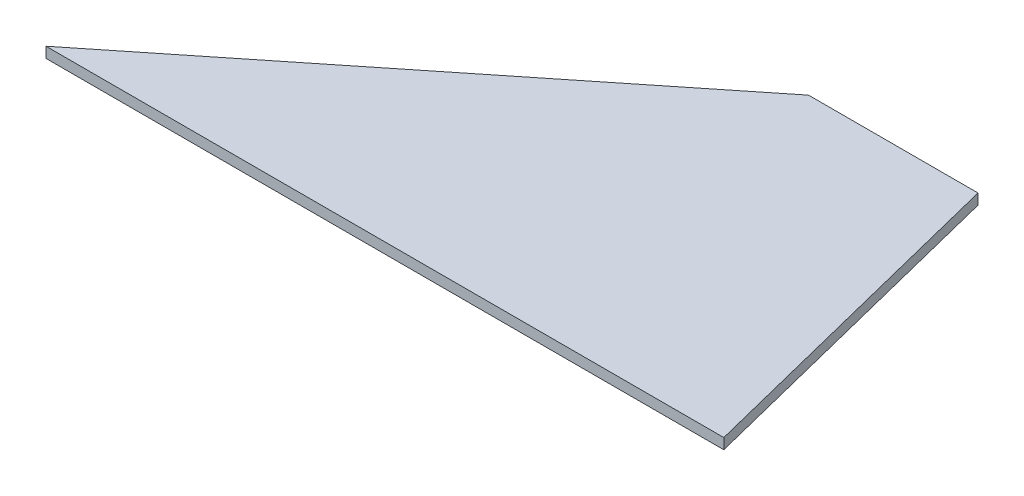
ISO-10303-21;
HEADER;
FILE_DESCRIPTION(('STEP AP214'),'2;1');
FILE_NAME('part.step','',(''),(''),'','','');
FILE_SCHEMA(('AUTOMOTIVE_DESIGN { 1 0 10303 214 1 1 1 1 }'));
ENDSEC;
DATA;
#1=APPLICATION_CONTEXT('core data for automotive mechanical design processes');
#2=APPLICATION_PROTOCOL_DEFINITION('international standard','automotive_design',2000,#1);
#3=PRODUCT_CONTEXT('',#1,'mechanical');
#4=PRODUCT('Part','Part','',(#3));
#5=PRODUCT_RELATED_PRODUCT_CATEGORY('part','',(#4));
#6=PRODUCT_DEFINITION_FORMATION('','',#4);
#7=PRODUCT_DEFINITION_CONTEXT('part definition',#1,'design');
#8=PRODUCT_DEFINITION('design','',#6,#7);
#9=PRODUCT_DEFINITION_SHAPE('','',#8);
#10=(LENGTH_UNIT() NAMED_UNIT(*) SI_UNIT(.MILLI.,.METRE.));
#11=(NAMED_UNIT(*) PLANE_ANGLE_UNIT() SI_UNIT($,.RADIAN.));
#12=(NAMED_UNIT(*) SI_UNIT($,.STERADIAN.) SOLID_ANGLE_UNIT());
#13=UNCERTAINTY_MEASURE_WITH_UNIT(LENGTH_MEASURE(1.E-05),#10,'distance_accuracy_value','');
#14=(GEOMETRIC_REPRESENTATION_CONTEXT(3) GLOBAL_UNCERTAINTY_ASSIGNED_CONTEXT((#13)) GLOBAL_UNIT_ASSIGNED_CONTEXT((#10,
#11,#12)) REPRESENTATION_CONTEXT('',''));
#15=CARTESIAN_POINT('',(0.,0.,0.));
#16=DIRECTION('',(0.,0.,1.));
#17=DIRECTION('',(1.,0.,0.));
#18=AXIS2_PLACEMENT_3D('',#15,#16,#17);
#19=CARTESIAN_POINT('',(-50.8,6.35,-203.2));
#20=DIRECTION('',(-0.970142500145332,0.,0.242535625036333));
#21=DIRECTION('',(0.242535625036333,0.,0.970142500145332));
#22=AXIS2_PLACEMENT_3D('',#19,#20,#21);
#23=PLANE('',#22);
#24=DIRECTION('',(-0.242535625036333,0.,-0.970142500145332));
#25=VECTOR('',#24,1.);
#26=CARTESIAN_POINT('',(-50.8,0.,-203.2));
#27=LINE('',#26,#25);
#28=CARTESIAN_POINT('',(0.,0.,0.));
#29=VERTEX_POINT('',#28);
#30=CARTESIAN_POINT('',(-50.8,0.,-203.2));
#31=VERTEX_POINT('',#30);
#32=EDGE_CURVE('E97',#29,#31,#27,.T.);
#33=ORIENTED_EDGE('',*,*,#32,.T.);
#34=DIRECTION('',(0.,-1.,0.));
#35=VECTOR('',#34,1.);
#36=CARTESIAN_POINT('',(-50.8,6.35,-203.2));
#37=LINE('',#36,#35);
#38=CARTESIAN_POINT('',(-50.8,6.35,-203.2));
#39=VERTEX_POINT('',#38);
#40=EDGE_CURVE('E11',#39,#31,#37,.T.);
#41=ORIENTED_EDGE('',*,*,#40,.F.);
#42=DIRECTION('',(-0.242535625036333,0.,-0.970142500145332));
#43=VECTOR('',#42,1.);
#44=CARTESIAN_POINT('',(-50.8,6.35,-203.2));
#45=LINE('',#44,#43);
#46=CARTESIAN_POINT('',(0.,6.35,0.));
#47=VERTEX_POINT('',#46);
#48=EDGE_CURVE('E85',#47,#39,#45,.T.);
#49=ORIENTED_EDGE('',*,*,#48,.F.);
#50=DIRECTION('',(0.,-1.,0.));
#51=VECTOR('',#50,1.);
#52=CARTESIAN_POINT('',(0.,6.35,0.));
#53=LINE('',#52,#51);
#54=EDGE_CURVE('E93',#47,#29,#53,.T.);
#55=ORIENTED_EDGE('',*,*,#54,.T.);
#56=EDGE_LOOP('',(#33,#41,#49,#55));
#57=FACE_BOUND('',#56,.T.);
#58=ADVANCED_FACE('F34',(#57),#23,.F.);
#59=CARTESIAN_POINT('',(-152.4,6.35,-203.2));
#60=DIRECTION('',(0.,0.,1.));
#61=DIRECTION('',(1.,0.,0.));
#62=AXIS2_PLACEMENT_3D('',#59,#60,#61);
#63=PLANE('',#62);
#64=DIRECTION('',(-1.,0.,0.));
#65=VECTOR('',#64,1.);
#66=CARTESIAN_POINT('',(-152.4,0.,-203.2));
#67=LINE('',#66,#65);
#68=CARTESIAN_POINT('',(-152.4,0.,-203.2));
#69=VERTEX_POINT('',#68);
#70=EDGE_CURVE('E89',#31,#69,#67,.T.);
#71=ORIENTED_EDGE('',*,*,#70,.T.);
#72=DIRECTION('',(0.,-1.,0.));
#73=VECTOR('',#72,1.);
#74=CARTESIAN_POINT('',(-152.4,6.35,-203.2));
#75=LINE('',#74,#73);
#76=CARTESIAN_POINT('',(-152.4,6.35,-203.2));
#77=VERTEX_POINT('',#76);
#78=EDGE_CURVE('E42',#77,#69,#75,.T.);
#79=ORIENTED_EDGE('',*,*,#78,.F.);
#80=DIRECTION('',(-1.,0.,0.));
#81=VECTOR('',#80,1.);
#82=CARTESIAN_POINT('',(-152.4,6.35,-203.2));
#83=LINE('',#82,#81);
#84=EDGE_CURVE('E80',#39,#77,#83,.T.);
#85=ORIENTED_EDGE('',*,*,#84,.F.);
#86=ORIENTED_EDGE('',*,*,#40,.T.);
#87=EDGE_LOOP('',(#71,#79,#85,#86));
#88=FACE_BOUND('',#87,.T.);
#89=ADVANCED_FACE('F88',(#88),#63,.F.);
#90=CARTESIAN_POINT('',(-406.4,6.35,0.));
#91=DIRECTION('',(0.624695047554424,0.,0.78086880944303));
#92=DIRECTION('',(0.78086880944303,0.,-0.624695047554424));
#93=AXIS2_PLACEMENT_3D('',#90,#91,#92);
#94=PLANE('',#93);
#95=DIRECTION('',(-0.78086880944303,0.,0.624695047554424));
#96=VECTOR('',#95,1.);
#97=CARTESIAN_POINT('',(-406.4,0.,0.));
#98=LINE('',#97,#96);
#99=CARTESIAN_POINT('',(-406.4,0.,0.));
#100=VERTEX_POINT('',#99);
#101=EDGE_CURVE('E67',#69,#100,#98,.T.);
#102=ORIENTED_EDGE('',*,*,#101,.T.);
#103=DIRECTION('',(0.,-1.,0.));
#104=VECTOR('',#103,1.);
#105=CARTESIAN_POINT('',(-406.4,6.35,0.));
#106=LINE('',#105,#104);
#107=CARTESIAN_POINT('',(-406.4,6.35,0.));
#108=VERTEX_POINT('',#107);
#109=EDGE_CURVE('E90',#108,#100,#106,.T.);
#110=ORIENTED_EDGE('',*,*,#109,.F.);
#111=DIRECTION('',(-0.78086880944303,0.,0.624695047554424));
#112=VECTOR('',#111,1.);
#113=CARTESIAN_POINT('',(-406.4,6.35,0.));
#114=LINE('',#113,#112);
#115=EDGE_CURVE('E83',#77,#108,#114,.T.);
#116=ORIENTED_EDGE('',*,*,#115,.F.);
#117=ORIENTED_EDGE('',*,*,#78,.T.);
#118=EDGE_LOOP('',(#102,#110,#116,#117));
#119=FACE_BOUND('',#118,.T.);
#120=ADVANCED_FACE('F91',(#119),#94,.F.);
#121=CARTESIAN_POINT('',(0.,6.35,0.));
#122=DIRECTION('',(0.,0.,-1.));
#123=DIRECTION('',(-1.,0.,0.));
#124=AXIS2_PLACEMENT_3D('',#121,#122,#123);
#125=PLANE('',#124);
#126=DIRECTION('',(1.,0.,0.));
#127=VECTOR('',#126,1.);
#128=CARTESIAN_POINT('',(0.,0.,0.));
#129=LINE('',#128,#127);
#130=EDGE_CURVE('E73',#100,#29,#129,.T.);
#131=ORIENTED_EDGE('',*,*,#130,.T.);
#132=ORIENTED_EDGE('',*,*,#54,.F.);
#133=DIRECTION('',(1.,0.,0.));
#134=VECTOR('',#133,1.);
#135=CARTESIAN_POINT('',(0.,6.35,0.));
#136=LINE('',#135,#134);
#137=EDGE_CURVE('E50',#108,#47,#136,.T.);
#138=ORIENTED_EDGE('',*,*,#137,.F.);
#139=ORIENTED_EDGE('',*,*,#109,.T.);
#140=EDGE_LOOP('',(#131,#132,#138,#139));
#141=FACE_BOUND('',#140,.T.);
#142=ADVANCED_FACE('F104',(#141),#125,.F.);
#143=CARTESIAN_POINT('',(0.,6.35,0.));
#144=DIRECTION('',(0.,-1.,0.));
#145=DIRECTION('',(0.,0.,-1.));
#146=AXIS2_PLACEMENT_3D('',#143,#144,#145);
#147=PLANE('',#146);
#148=ORIENTED_EDGE('',*,*,#48,.T.);
#149=ORIENTED_EDGE('',*,*,#84,.T.);
#150=ORIENTED_EDGE('',*,*,#115,.T.);
#151=ORIENTED_EDGE('',*,*,#137,.T.);
#152=EDGE_LOOP('',(#148,#149,#150,#151));
#153=FACE_BOUND('',#152,.T.);
#154=ADVANCED_FACE('F81',(#153),#147,.F.);
#155=CARTESIAN_POINT('',(0.,0.,0.));
#156=DIRECTION('',(0.,-1.,0.));
#157=DIRECTION('',(0.,0.,-1.));
#158=AXIS2_PLACEMENT_3D('',#155,#156,#157);
#159=PLANE('',#158);
#160=ORIENTED_EDGE('',*,*,#32,.F.);
#161=ORIENTED_EDGE('',*,*,#130,.F.);
#162=ORIENTED_EDGE('',*,*,#101,.F.);
#163=ORIENTED_EDGE('',*,*,#70,.F.);
#164=EDGE_LOOP('',(#160,#161,#162,#163));
#165=FACE_BOUND('',#164,.T.);
#166=ADVANCED_FACE('F107',(#165),#159,.T.);
#167=CLOSED_SHELL('',(#58,#89,#120,#142,#154,#166));
#168=MANIFOLD_SOLID_BREP('B2',#167);
#169=ADVANCED_BREP_SHAPE_REPRESENTATION('',(#18,#168),#14);
#170=SHAPE_DEFINITION_REPRESENTATION(#9,#169);
ENDSEC;
END-ISO-10303-21;
